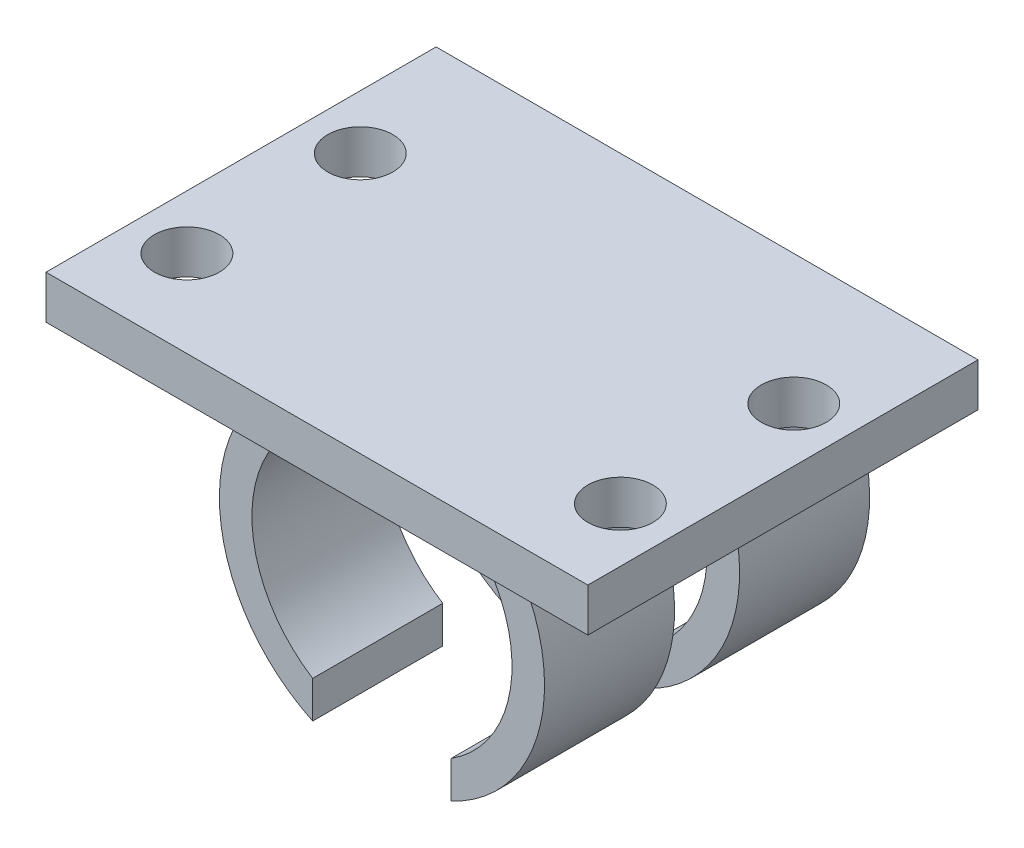
ISO-10303-21;
HEADER;
FILE_DESCRIPTION(('STEP AP214'),'2;1');
FILE_NAME('part.step','',(''),(''),'','','');
FILE_SCHEMA(('AUTOMOTIVE_DESIGN { 1 0 10303 214 1 1 1 1 }'));
ENDSEC;
DATA;
#1=APPLICATION_CONTEXT('core data for automotive mechanical design processes');
#2=APPLICATION_PROTOCOL_DEFINITION('international standard','automotive_design',2000,#1);
#3=PRODUCT_CONTEXT('',#1,'mechanical');
#4=PRODUCT('Part','Part','',(#3));
#5=PRODUCT_RELATED_PRODUCT_CATEGORY('part','',(#4));
#6=PRODUCT_DEFINITION_FORMATION('','',#4);
#7=PRODUCT_DEFINITION_CONTEXT('part definition',#1,'design');
#8=PRODUCT_DEFINITION('design','',#6,#7);
#9=PRODUCT_DEFINITION_SHAPE('','',#8);
#10=(LENGTH_UNIT() NAMED_UNIT(*) SI_UNIT(.MILLI.,.METRE.));
#11=(NAMED_UNIT(*) PLANE_ANGLE_UNIT() SI_UNIT($,.RADIAN.));
#12=(NAMED_UNIT(*) SI_UNIT($,.STERADIAN.) SOLID_ANGLE_UNIT());
#13=UNCERTAINTY_MEASURE_WITH_UNIT(LENGTH_MEASURE(1.E-05),#10,'distance_accuracy_value','');
#14=(GEOMETRIC_REPRESENTATION_CONTEXT(3) GLOBAL_UNCERTAINTY_ASSIGNED_CONTEXT((#13)) GLOBAL_UNIT_ASSIGNED_CONTEXT((#10,
#11,#12)) REPRESENTATION_CONTEXT('',''));
#15=CARTESIAN_POINT('',(0.,0.,0.));
#16=DIRECTION('',(0.,0.,1.));
#17=DIRECTION('',(1.,0.,0.));
#18=AXIS2_PLACEMENT_3D('',#15,#16,#17);
#19=CARTESIAN_POINT('',(-3.19588061843874,0.,15.));
#20=DIRECTION('',(1.,0.,0.));
#21=DIRECTION('',(0.,0.,-1.));
#22=AXIS2_PLACEMENT_3D('',#19,#20,#21);
#23=PLANE('',#22);
#24=DIRECTION('',(0.,-1.,0.));
#25=VECTOR('',#24,1.);
#26=CARTESIAN_POINT('',(-3.19588061843874,0.,9.));
#27=LINE('',#26,#25);
#28=CARTESIAN_POINT('',(-3.19588061843874,-5.07802590311311,9.));
#29=VERTEX_POINT('',#28);
#30=CARTESIAN_POINT('',(-3.19588061843874,-6.78500899577057,9.));
#31=VERTEX_POINT('',#30);
#32=EDGE_CURVE('E250',#29,#31,#27,.T.);
#33=ORIENTED_EDGE('',*,*,#32,.F.);
#34=DIRECTION('',(0.,0.,-1.));
#35=VECTOR('',#34,1.);
#36=CARTESIAN_POINT('',(-3.19588061843874,-5.07802590311311,15.));
#37=LINE('',#36,#35);
#38=CARTESIAN_POINT('',(-3.19588061843874,-5.07802590311311,15.));
#39=VERTEX_POINT('',#38);
#40=EDGE_CURVE('E317',#39,#29,#37,.T.);
#41=ORIENTED_EDGE('',*,*,#40,.F.);
#42=DIRECTION('',(0.,-1.,0.));
#43=VECTOR('',#42,1.);
#44=CARTESIAN_POINT('',(-3.19588061843874,0.,15.));
#45=LINE('',#44,#43);
#46=CARTESIAN_POINT('',(-3.19588061843874,-6.78500899577057,15.));
#47=VERTEX_POINT('',#46);
#48=EDGE_CURVE('E273',#39,#47,#45,.T.);
#49=ORIENTED_EDGE('',*,*,#48,.T.);
#50=DIRECTION('',(0.,0.,-1.));
#51=VECTOR('',#50,1.);
#52=CARTESIAN_POINT('',(-3.19588061843874,-6.78500899577057,15.));
#53=LINE('',#52,#51);
#54=EDGE_CURVE('E321',#47,#31,#53,.T.);
#55=ORIENTED_EDGE('',*,*,#54,.T.);
#56=EDGE_LOOP('',(#33,#41,#49,#55));
#57=FACE_BOUND('',#56,.T.);
#58=ADVANCED_FACE('F41',(#57),#23,.T.);
#59=CARTESIAN_POINT('',(3.19588060787419,-0.000259857829272418,15.));
#60=DIRECTION('',(0.999999996694322,-8.13102428711384E-05,0.));
#61=DIRECTION('',(8.13102428711384E-05,0.999999996694322,0.));
#62=AXIS2_PLACEMENT_3D('',#59,#60,#61);
#63=PLANE('',#62);
#64=DIRECTION('',(0.,0.,-1.));
#65=VECTOR('',#64,1.);
#66=CARTESIAN_POINT('',(3.1954677123547,-5.07828574415607,15.));
#67=LINE('',#66,#65);
#68=CARTESIAN_POINT('',(3.1954677123547,-5.07828574415607,15.));
#69=VERTEX_POINT('',#68);
#70=CARTESIAN_POINT('',(3.1954677123547,-5.07828574415607,9.));
#71=VERTEX_POINT('',#70);
#72=EDGE_CURVE('E309',#69,#71,#67,.T.);
#73=ORIENTED_EDGE('',*,*,#72,.T.);
#74=DIRECTION('',(-8.13102428711384E-05,-0.999999996694322,0.));
#75=VECTOR('',#74,1.);
#76=CARTESIAN_POINT('',(3.19588060787419,-0.000259857829272418,9.));
#77=LINE('',#76,#75);
#78=CARTESIAN_POINT('',(3.19532891714486,-6.7852688311708,9.));
#79=VERTEX_POINT('',#78);
#80=EDGE_CURVE('E49',#71,#79,#77,.T.);
#81=ORIENTED_EDGE('',*,*,#80,.T.);
#82=DIRECTION('',(0.,0.,-1.));
#83=VECTOR('',#82,1.);
#84=CARTESIAN_POINT('',(3.19532891714486,-6.7852688311708,15.));
#85=LINE('',#84,#83);
#86=CARTESIAN_POINT('',(3.19532891714486,-6.7852688311708,15.));
#87=VERTEX_POINT('',#86);
#88=EDGE_CURVE('E305',#87,#79,#85,.T.);
#89=ORIENTED_EDGE('',*,*,#88,.F.);
#90=DIRECTION('',(-8.13102428711384E-05,-0.999999996694322,0.));
#91=VECTOR('',#90,1.);
#92=CARTESIAN_POINT('',(3.19588060787419,-0.000259857829272418,15.));
#93=LINE('',#92,#91);
#94=EDGE_CURVE('E283',#69,#87,#93,.T.);
#95=ORIENTED_EDGE('',*,*,#94,.F.);
#96=EDGE_LOOP('',(#73,#81,#89,#95));
#97=FACE_BOUND('',#96,.T.);
#98=ADVANCED_FACE('F332',(#97),#63,.F.);
#99=CARTESIAN_POINT('',(0.,0.,15.));
#100=DIRECTION('',(0.,0.,-1.));
#101=DIRECTION('',(-1.,0.,0.));
#102=AXIS2_PLACEMENT_3D('',#99,#100,#101);
#103=CYLINDRICAL_SURFACE('',#102,7.5);
#104=CARTESIAN_POINT('',(0.,0.,6.));
#105=DIRECTION('',(0.,0.,-1.));
#106=DIRECTION('',(-1.,0.,0.));
#107=AXIS2_PLACEMENT_3D('',#104,#105,#106);
#108=CIRCLE('',#107,7.5);
#109=CARTESIAN_POINT('',(3.19532891714486,-6.7852688311708,6.));
#110=VERTEX_POINT('',#109);
#111=CARTESIAN_POINT('',(6.77609795621035,3.2147311688292,6.));
#112=VERTEX_POINT('',#111);
#113=EDGE_CURVE('E235',#110,#112,#108,.F.);
#114=ORIENTED_EDGE('',*,*,#113,.F.);
#115=CARTESIAN_POINT('',(3.19532891714486,-6.7852688311708,0.));
#116=VERTEX_POINT('',#115);
#117=EDGE_CURVE('E285',#110,#116,#85,.T.);
#118=ORIENTED_EDGE('',*,*,#117,.T.);
#119=CARTESIAN_POINT('',(0.,0.,0.));
#120=DIRECTION('',(0.,0.,1.));
#121=DIRECTION('',(1.,0.,0.));
#122=AXIS2_PLACEMENT_3D('',#119,#120,#121);
#123=CIRCLE('',#122,7.5);
#124=CARTESIAN_POINT('',(4.50092143540609,5.9993088128802,0.));
#125=VERTEX_POINT('',#124);
#126=EDGE_CURVE('E263',#125,#116,#123,.F.);
#127=ORIENTED_EDGE('',*,*,#126,.F.);
#128=DIRECTION('',(0.,0.,-1.));
#129=VECTOR('',#128,1.);
#130=CARTESIAN_POINT('',(4.50092143540609,5.9993088128802,15.));
#131=LINE('',#130,#129);
#132=CARTESIAN_POINT('',(4.50092143540609,5.9993088128802,15.));
#133=VERTEX_POINT('',#132);
#134=EDGE_CURVE('E326',#133,#125,#131,.T.);
#135=ORIENTED_EDGE('',*,*,#134,.F.);
#136=CARTESIAN_POINT('',(0.,0.,15.));
#137=DIRECTION('',(0.,0.,1.));
#138=DIRECTION('',(1.,0.,0.));
#139=AXIS2_PLACEMENT_3D('',#136,#137,#138);
#140=CIRCLE('',#139,7.5);
#141=EDGE_CURVE('E264',#133,#87,#140,.F.);
#142=ORIENTED_EDGE('',*,*,#141,.T.);
#143=ORIENTED_EDGE('',*,*,#88,.T.);
#144=CARTESIAN_POINT('',(0.,0.,9.));
#145=DIRECTION('',(0.,0.,1.));
#146=DIRECTION('',(1.,0.,0.));
#147=AXIS2_PLACEMENT_3D('',#144,#145,#146);
#148=CIRCLE('',#147,7.5);
#149=CARTESIAN_POINT('',(6.77609795621035,3.2147311688292,9.));
#150=VERTEX_POINT('',#149);
#151=EDGE_CURVE('E245',#150,#79,#148,.F.);
#152=ORIENTED_EDGE('',*,*,#151,.F.);
#153=DIRECTION('',(0.,0.,-1.));
#154=VECTOR('',#153,1.);
#155=CARTESIAN_POINT('',(6.77609795621035,3.2147311688292,15.));
#156=LINE('',#155,#154);
#157=EDGE_CURVE('E261',#112,#150,#156,.F.);
#158=ORIENTED_EDGE('',*,*,#157,.F.);
#159=EDGE_LOOP('',(#114,#118,#127,#135,#142,#143,#152,#158));
#160=FACE_BOUND('',#159,.T.);
#161=ADVANCED_FACE('F43',(#160),#103,.T.);
#162=CARTESIAN_POINT('',(0.,0.,15.));
#163=DIRECTION('',(0.,0.,-1.));
#164=DIRECTION('',(-1.,0.,0.));
#165=AXIS2_PLACEMENT_3D('',#162,#163,#164);
#166=CYLINDRICAL_SURFACE('',#165,7.5);
#167=DIRECTION('',(0.,0.,-1.));
#168=VECTOR('',#167,1.);
#169=CARTESIAN_POINT('',(-6.77609795621034,3.2147311688292,15.));
#170=LINE('',#169,#168);
#171=CARTESIAN_POINT('',(-6.77609795621034,3.2147311688292,6.));
#172=VERTEX_POINT('',#171);
#173=CARTESIAN_POINT('',(-6.77609795621034,3.2147311688292,9.));
#174=VERTEX_POINT('',#173);
#175=EDGE_CURVE('E258',#172,#174,#170,.F.);
#176=ORIENTED_EDGE('',*,*,#175,.T.);
#177=CARTESIAN_POINT('',(0.,0.,9.));
#178=DIRECTION('',(0.,0.,1.));
#179=DIRECTION('',(1.,0.,0.));
#180=AXIS2_PLACEMENT_3D('',#177,#178,#179);
#181=CIRCLE('',#180,7.5);
#182=EDGE_CURVE('E253',#174,#31,#181,.T.);
#183=ORIENTED_EDGE('',*,*,#182,.T.);
#184=ORIENTED_EDGE('',*,*,#54,.F.);
#185=CARTESIAN_POINT('',(0.,0.,15.));
#186=DIRECTION('',(0.,0.,1.));
#187=DIRECTION('',(1.,0.,0.));
#188=AXIS2_PLACEMENT_3D('',#185,#186,#187);
#189=CIRCLE('',#188,7.5);
#190=CARTESIAN_POINT('',(-4.50043362796217,5.99967475454355,15.));
#191=VERTEX_POINT('',#190);
#192=EDGE_CURVE('E271',#191,#47,#189,.T.);
#193=ORIENTED_EDGE('',*,*,#192,.F.);
#194=DIRECTION('',(0.,0.,-1.));
#195=VECTOR('',#194,1.);
#196=CARTESIAN_POINT('',(-4.50043362796217,5.99967475454355,15.));
#197=LINE('',#196,#195);
#198=CARTESIAN_POINT('',(-4.50043362796217,5.99967475454355,0.));
#199=VERTEX_POINT('',#198);
#200=EDGE_CURVE('E324',#191,#199,#197,.T.);
#201=ORIENTED_EDGE('',*,*,#200,.T.);
#202=CARTESIAN_POINT('',(0.,0.,0.));
#203=DIRECTION('',(0.,0.,1.));
#204=DIRECTION('',(1.,0.,0.));
#205=AXIS2_PLACEMENT_3D('',#202,#203,#204);
#206=CIRCLE('',#205,7.5);
#207=CARTESIAN_POINT('',(-3.19588061843874,-6.78500899577057,0.));
#208=VERTEX_POINT('',#207);
#209=EDGE_CURVE('E288',#199,#208,#206,.T.);
#210=ORIENTED_EDGE('',*,*,#209,.T.);
#211=CARTESIAN_POINT('',(-3.19588061843874,-6.78500899577057,6.));
#212=VERTEX_POINT('',#211);
#213=EDGE_CURVE('E320',#212,#208,#53,.T.);
#214=ORIENTED_EDGE('',*,*,#213,.F.);
#215=CARTESIAN_POINT('',(0.,0.,6.));
#216=DIRECTION('',(0.,0.,-1.));
#217=DIRECTION('',(-1.,0.,0.));
#218=AXIS2_PLACEMENT_3D('',#215,#216,#217);
#219=CIRCLE('',#218,7.5);
#220=EDGE_CURVE('E240',#212,#172,#219,.T.);
#221=ORIENTED_EDGE('',*,*,#220,.T.);
#222=EDGE_LOOP('',(#176,#183,#184,#193,#201,#210,#214,#221));
#223=FACE_BOUND('',#222,.T.);
#224=ADVANCED_FACE('F346',(#223),#166,.T.);
#225=DIRECTION('',(0.,1.,0.));
#226=VECTOR('',#225,1.);
#227=CARTESIAN_POINT('',(-3.19588061843874,0.,6.));
#228=LINE('',#227,#226);
#229=CARTESIAN_POINT('',(-3.19588061843874,-5.07802590311311,6.));
#230=VERTEX_POINT('',#229);
#231=EDGE_CURVE('E56',#212,#230,#228,.T.);
#232=ORIENTED_EDGE('',*,*,#231,.F.);
#233=ORIENTED_EDGE('',*,*,#213,.T.);
#234=DIRECTION('',(0.,-1.,0.));
#235=VECTOR('',#234,1.);
#236=CARTESIAN_POINT('',(-3.19588061843874,0.,0.));
#237=LINE('',#236,#235);
#238=CARTESIAN_POINT('',(-3.19588061843874,-5.07802590311311,0.));
#239=VERTEX_POINT('',#238);
#240=EDGE_CURVE('E291',#239,#208,#237,.T.);
#241=ORIENTED_EDGE('',*,*,#240,.F.);
#242=EDGE_CURVE('E316',#230,#239,#37,.T.);
#243=ORIENTED_EDGE('',*,*,#242,.F.);
#244=EDGE_LOOP('',(#232,#233,#241,#243));
#245=FACE_BOUND('',#244,.T.);
#246=ADVANCED_FACE('F356',(#245),#23,.T.);
#247=CARTESIAN_POINT('',(0.,0.,15.));
#248=DIRECTION('',(0.,0.,-1.));
#249=DIRECTION('',(-1.,0.,0.));
#250=AXIS2_PLACEMENT_3D('',#247,#248,#249);
#251=CYLINDRICAL_SURFACE('',#250,6.);
#252=ORIENTED_EDGE('',*,*,#40,.T.);
#253=CARTESIAN_POINT('',(0.,0.,9.));
#254=DIRECTION('',(0.,0.,1.));
#255=DIRECTION('',(1.,0.,0.));
#256=AXIS2_PLACEMENT_3D('',#253,#254,#255);
#257=CIRCLE('',#256,6.);
#258=CARTESIAN_POINT('',(-5.06611325496757,3.2147311688292,9.));
#259=VERTEX_POINT('',#258);
#260=EDGE_CURVE('E247',#29,#259,#257,.F.);
#261=ORIENTED_EDGE('',*,*,#260,.T.);
#262=DIRECTION('',(0.,0.,-1.));
#263=VECTOR('',#262,1.);
#264=CARTESIAN_POINT('',(-5.06611325496757,3.2147311688292,15.));
#265=LINE('',#264,#263);
#266=CARTESIAN_POINT('',(-5.06611325496757,3.2147311688292,6.));
#267=VERTEX_POINT('',#266);
#268=EDGE_CURVE('E255',#259,#267,#265,.T.);
#269=ORIENTED_EDGE('',*,*,#268,.T.);
#270=CARTESIAN_POINT('',(0.,0.,6.));
#271=DIRECTION('',(0.,0.,-1.));
#272=DIRECTION('',(-1.,0.,0.));
#273=AXIS2_PLACEMENT_3D('',#270,#271,#272);
#274=CIRCLE('',#273,6.);
#275=EDGE_CURVE('E237',#267,#230,#274,.F.);
#276=ORIENTED_EDGE('',*,*,#275,.T.);
#277=ORIENTED_EDGE('',*,*,#242,.T.);
#278=CARTESIAN_POINT('',(0.,0.,0.));
#279=DIRECTION('',(0.,0.,1.));
#280=DIRECTION('',(1.,0.,0.));
#281=AXIS2_PLACEMENT_3D('',#278,#279,#280);
#282=CIRCLE('',#281,6.);
#283=CARTESIAN_POINT('',(-3.31642151200714,5.00013483365162,0.));
#284=VERTEX_POINT('',#283);
#285=EDGE_CURVE('E294',#239,#284,#282,.F.);
#286=ORIENTED_EDGE('',*,*,#285,.T.);
#287=DIRECTION('',(0.,0.,-1.));
#288=VECTOR('',#287,1.);
#289=CARTESIAN_POINT('',(-3.31642151200714,5.00013483365162,15.));
#290=LINE('',#289,#288);
#291=CARTESIAN_POINT('',(-3.31642151200714,5.00013483365162,15.));
#292=VERTEX_POINT('',#291);
#293=EDGE_CURVE('E314',#292,#284,#290,.T.);
#294=ORIENTED_EDGE('',*,*,#293,.F.);
#295=CARTESIAN_POINT('',(0.,0.,15.));
#296=DIRECTION('',(0.,0.,1.));
#297=DIRECTION('',(1.,0.,0.));
#298=AXIS2_PLACEMENT_3D('',#295,#296,#297);
#299=CIRCLE('',#298,6.);
#300=EDGE_CURVE('E276',#39,#292,#299,.F.);
#301=ORIENTED_EDGE('',*,*,#300,.F.);
#302=EDGE_LOOP('',(#252,#261,#269,#276,#277,#286,#294,#301));
#303=FACE_BOUND('',#302,.T.);
#304=ADVANCED_FACE('F366',(#303),#251,.F.);
#305=CARTESIAN_POINT('',(0.000203275607340872,4.9999999958679,15.));
#306=DIRECTION('',(-4.06551214681743E-05,-0.99999999917358,0.));
#307=DIRECTION('',(0.999999999173581,-4.06551214681743E-05,0.));
#308=AXIS2_PLACEMENT_3D('',#305,#306,#307);
#309=PLANE('',#308);
#310=DIRECTION('',(-0.999999999173581,4.06551214681743E-05,0.));
#311=VECTOR('',#310,1.);
#312=CARTESIAN_POINT('',(0.000203275607340872,4.9999999958679,0.));
#313=LINE('',#312,#311);
#314=CARTESIAN_POINT('',(3.31682806322183,4.99986515808419,0.));
#315=VERTEX_POINT('',#314);
#316=EDGE_CURVE('E297',#315,#284,#313,.T.);
#317=ORIENTED_EDGE('',*,*,#316,.F.);
#318=DIRECTION('',(0.,0.,-1.));
#319=VECTOR('',#318,1.);
#320=CARTESIAN_POINT('',(3.31682806322183,4.99986515808419,15.));
#321=LINE('',#320,#319);
#322=CARTESIAN_POINT('',(3.31682806322183,4.99986515808419,15.));
#323=VERTEX_POINT('',#322);
#324=EDGE_CURVE('E312',#323,#315,#321,.T.);
#325=ORIENTED_EDGE('',*,*,#324,.F.);
#326=DIRECTION('',(-0.999999999173581,4.06551214681743E-05,0.));
#327=VECTOR('',#326,1.);
#328=CARTESIAN_POINT('',(0.000203275607340872,4.9999999958679,15.));
#329=LINE('',#328,#327);
#330=EDGE_CURVE('E278',#323,#292,#329,.T.);
#331=ORIENTED_EDGE('',*,*,#330,.T.);
#332=ORIENTED_EDGE('',*,*,#293,.T.);
#333=EDGE_LOOP('',(#317,#325,#331,#332));
#334=FACE_BOUND('',#333,.T.);
#335=ADVANCED_FACE('F377',(#334),#309,.T.);
#336=CARTESIAN_POINT('',(0.,0.,15.));
#337=DIRECTION('',(0.,0.,-1.));
#338=DIRECTION('',(-1.,0.,0.));
#339=AXIS2_PLACEMENT_3D('',#336,#337,#338);
#340=CYLINDRICAL_SURFACE('',#339,6.00000000000001);
#341=DIRECTION('',(0.,0.,-1.));
#342=VECTOR('',#341,1.);
#343=CARTESIAN_POINT('',(5.06611325496757,3.2147311688292,15.));
#344=LINE('',#343,#342);
#345=CARTESIAN_POINT('',(5.06611325496757,3.2147311688292,6.));
#346=VERTEX_POINT('',#345);
#347=CARTESIAN_POINT('',(5.06611325496757,3.2147311688292,9.));
#348=VERTEX_POINT('',#347);
#349=EDGE_CURVE('E11',#346,#348,#344,.F.);
#350=ORIENTED_EDGE('',*,*,#349,.T.);
#351=CARTESIAN_POINT('',(0.,0.,9.));
#352=DIRECTION('',(0.,0.,1.));
#353=DIRECTION('',(1.,0.,0.));
#354=AXIS2_PLACEMENT_3D('',#351,#352,#353);
#355=CIRCLE('',#354,6.00000000000001);
#356=EDGE_CURVE('E242',#348,#71,#355,.F.);
#357=ORIENTED_EDGE('',*,*,#356,.T.);
#358=ORIENTED_EDGE('',*,*,#72,.F.);
#359=CARTESIAN_POINT('',(0.,0.,15.));
#360=DIRECTION('',(0.,0.,1.));
#361=DIRECTION('',(1.,0.,0.));
#362=AXIS2_PLACEMENT_3D('',#359,#360,#361);
#363=CIRCLE('',#362,6.00000000000001);
#364=EDGE_CURVE('E281',#323,#69,#363,.F.);
#365=ORIENTED_EDGE('',*,*,#364,.F.);
#366=ORIENTED_EDGE('',*,*,#324,.T.);
#367=CARTESIAN_POINT('',(0.,0.,0.));
#368=DIRECTION('',(0.,0.,1.));
#369=DIRECTION('',(1.,0.,0.));
#370=AXIS2_PLACEMENT_3D('',#367,#368,#369);
#371=CIRCLE('',#370,6.00000000000001);
#372=CARTESIAN_POINT('',(3.1954677123547,-5.07828574415607,0.));
#373=VERTEX_POINT('',#372);
#374=EDGE_CURVE('E300',#315,#373,#371,.F.);
#375=ORIENTED_EDGE('',*,*,#374,.T.);
#376=CARTESIAN_POINT('',(3.1954677123547,-5.07828574415607,6.));
#377=VERTEX_POINT('',#376);
#378=EDGE_CURVE('E308',#377,#373,#67,.T.);
#379=ORIENTED_EDGE('',*,*,#378,.F.);
#380=CARTESIAN_POINT('',(0.,0.,6.));
#381=DIRECTION('',(0.,0.,-1.));
#382=DIRECTION('',(-1.,0.,0.));
#383=AXIS2_PLACEMENT_3D('',#380,#381,#382);
#384=CIRCLE('',#383,6.00000000000001);
#385=EDGE_CURVE('E64',#377,#346,#384,.F.);
#386=ORIENTED_EDGE('',*,*,#385,.T.);
#387=EDGE_LOOP('',(#350,#357,#358,#365,#366,#375,#379,#386));
#388=FACE_BOUND('',#387,.T.);
#389=ADVANCED_FACE('F381',(#388),#340,.F.);
#390=ORIENTED_EDGE('',*,*,#117,.F.);
#391=DIRECTION('',(8.13102428711384E-05,0.999999996694322,0.));
#392=VECTOR('',#391,1.);
#393=CARTESIAN_POINT('',(3.19588060787419,-0.000259857829272418,6.));
#394=LINE('',#393,#392);
#395=EDGE_CURVE('E328',#110,#377,#394,.T.);
#396=ORIENTED_EDGE('',*,*,#395,.T.);
#397=ORIENTED_EDGE('',*,*,#378,.T.);
#398=DIRECTION('',(-8.13102428711384E-05,-0.999999996694322,0.));
#399=VECTOR('',#398,1.);
#400=CARTESIAN_POINT('',(3.19588060787419,-0.000259857829272418,0.));
#401=LINE('',#400,#399);
#402=EDGE_CURVE('E268',#373,#116,#401,.T.);
#403=ORIENTED_EDGE('',*,*,#402,.T.);
#404=EDGE_LOOP('',(#390,#396,#397,#403));
#405=FACE_BOUND('',#404,.T.);
#406=ADVANCED_FACE('F390',(#405),#63,.F.);
#407=CARTESIAN_POINT('',(0.,0.,15.));
#408=DIRECTION('',(0.,0.,1.));
#409=DIRECTION('',(1.,0.,0.));
#410=AXIS2_PLACEMENT_3D('',#407,#408,#409);
#411=PLANE('',#410);
#412=ORIENTED_EDGE('',*,*,#141,.F.);
#413=DIRECTION('',(0.999999999173624,-4.06540638019069E-05,0.));
#414=VECTOR('',#413,1.);
#415=CARTESIAN_POINT('',(0.000243903721955595,5.99949178371188,15.));
#416=LINE('',#415,#414);
#417=EDGE_CURVE('E267',#191,#133,#416,.T.);
#418=ORIENTED_EDGE('',*,*,#417,.F.);
#419=ORIENTED_EDGE('',*,*,#192,.T.);
#420=ORIENTED_EDGE('',*,*,#48,.F.);
#421=ORIENTED_EDGE('',*,*,#300,.T.);
#422=ORIENTED_EDGE('',*,*,#330,.F.);
#423=ORIENTED_EDGE('',*,*,#364,.T.);
#424=ORIENTED_EDGE('',*,*,#94,.T.);
#425=EDGE_LOOP('',(#412,#418,#419,#420,#421,#422,#423,#424));
#426=FACE_BOUND('',#425,.T.);
#427=ADVANCED_FACE('F342',(#426),#411,.T.);
#428=CARTESIAN_POINT('',(0.,0.,0.));
#429=DIRECTION('',(0.,0.,1.));
#430=DIRECTION('',(1.,0.,0.));
#431=AXIS2_PLACEMENT_3D('',#428,#429,#430);
#432=PLANE('',#431);
#433=ORIENTED_EDGE('',*,*,#126,.T.);
#434=ORIENTED_EDGE('',*,*,#402,.F.);
#435=ORIENTED_EDGE('',*,*,#374,.F.);
#436=ORIENTED_EDGE('',*,*,#316,.T.);
#437=ORIENTED_EDGE('',*,*,#285,.F.);
#438=ORIENTED_EDGE('',*,*,#240,.T.);
#439=ORIENTED_EDGE('',*,*,#209,.F.);
#440=DIRECTION('',(0.999999999173624,-4.06540638019069E-05,0.));
#441=VECTOR('',#440,1.);
#442=CARTESIAN_POINT('',(0.000243903721955595,5.99949178371188,0.));
#443=LINE('',#442,#441);
#444=CARTESIAN_POINT('',(-12.5006504246368,5.9999999958679,0.));
#445=VERTEX_POINT('',#444);
#446=EDGE_CURVE('E213',#445,#199,#443,.T.);
#447=ORIENTED_EDGE('',*,*,#446,.F.);
#448=DIRECTION('',(0.,1.,0.));
#449=VECTOR('',#448,1.);
#450=CARTESIAN_POINT('',(-12.5006504246368,0.,0.));
#451=LINE('',#450,#449);
#452=CARTESIAN_POINT('',(-12.5006504246368,8.00034562911295,0.));
#453=VERTEX_POINT('',#452);
#454=EDGE_CURVE('E189',#445,#453,#451,.T.);
#455=ORIENTED_EDGE('',*,*,#454,.T.);
#456=DIRECTION('',(-0.999999999173438,4.06586283130755E-05,0.));
#457=VECTOR('',#456,1.);
#458=CARTESIAN_POINT('',(0.000325262413915438,7.99983735658852,0.));
#459=LINE('',#458,#457);
#460=CARTESIAN_POINT('',(12.5006504742254,7.99932911051152,0.));
#461=VERTEX_POINT('',#460);
#462=EDGE_CURVE('E218',#461,#453,#459,.T.);
#463=ORIENTED_EDGE('',*,*,#462,.F.);
#464=DIRECTION('',(-8.1310242876319E-05,-0.999999996694322,0.));
#465=VECTOR('',#464,1.);
#466=CARTESIAN_POINT('',(12.4999999641885,-0.00101637803640196,0.));
#467=LINE('',#466,#465);
#468=CARTESIAN_POINT('',(12.5004878256454,5.99898359799752,0.));
#469=VERTEX_POINT('',#468);
#470=EDGE_CURVE('E216',#461,#469,#467,.T.);
#471=ORIENTED_EDGE('',*,*,#470,.T.);
#472=EDGE_CURVE('E197',#125,#469,#443,.T.);
#473=ORIENTED_EDGE('',*,*,#472,.F.);
#474=EDGE_LOOP('',(#433,#434,#435,#436,#437,#438,#439,#447,#455,#463,#471,#473));
#475=FACE_BOUND('',#474,.T.);
#476=ADVANCED_FACE('F350',(#475),#432,.F.);
#477=CARTESIAN_POINT('',(-7.5,-6.7852688311708,9.));
#478=DIRECTION('',(0.,0.,1.));
#479=DIRECTION('',(1.,0.,0.));
#480=AXIS2_PLACEMENT_3D('',#477,#478,#479);
#481=PLANE('',#480);
#482=ORIENTED_EDGE('',*,*,#151,.T.);
#483=ORIENTED_EDGE('',*,*,#80,.F.);
#484=ORIENTED_EDGE('',*,*,#356,.F.);
#485=DIRECTION('',(1.,0.,0.));
#486=VECTOR('',#485,1.);
#487=CARTESIAN_POINT('',(-7.5,3.2147311688292,9.));
#488=LINE('',#487,#486);
#489=EDGE_CURVE('E227',#348,#150,#488,.T.);
#490=ORIENTED_EDGE('',*,*,#489,.T.);
#491=EDGE_LOOP('',(#482,#483,#484,#490));
#492=FACE_BOUND('',#491,.T.);
#493=ADVANCED_FACE('F383',(#492),#481,.F.);
#494=CARTESIAN_POINT('',(-7.5,3.2147311688292,6.));
#495=DIRECTION('',(0.,0.,-1.));
#496=DIRECTION('',(-1.,0.,0.));
#497=AXIS2_PLACEMENT_3D('',#494,#495,#496);
#498=PLANE('',#497);
#499=ORIENTED_EDGE('',*,*,#113,.T.);
#500=DIRECTION('',(1.,0.,0.));
#501=VECTOR('',#500,1.);
#502=CARTESIAN_POINT('',(-7.5,3.2147311688292,6.));
#503=LINE('',#502,#501);
#504=EDGE_CURVE('E201',#346,#112,#503,.T.);
#505=ORIENTED_EDGE('',*,*,#504,.F.);
#506=ORIENTED_EDGE('',*,*,#385,.F.);
#507=ORIENTED_EDGE('',*,*,#395,.F.);
#508=EDGE_LOOP('',(#499,#505,#506,#507));
#509=FACE_BOUND('',#508,.T.);
#510=ADVANCED_FACE('F387',(#509),#498,.F.);
#511=CARTESIAN_POINT('',(-7.5,3.2147311688292,9.));
#512=DIRECTION('',(0.,1.,0.));
#513=DIRECTION('',(0.,0.,1.));
#514=AXIS2_PLACEMENT_3D('',#511,#512,#513);
#515=PLANE('',#514);
#516=ORIENTED_EDGE('',*,*,#157,.T.);
#517=ORIENTED_EDGE('',*,*,#489,.F.);
#518=ORIENTED_EDGE('',*,*,#349,.F.);
#519=ORIENTED_EDGE('',*,*,#504,.T.);
#520=EDGE_LOOP('',(#516,#517,#518,#519));
#521=FACE_BOUND('',#520,.T.);
#522=ADVANCED_FACE('F385',(#521),#515,.F.);
#523=EDGE_CURVE('E231',#172,#267,#503,.T.);
#524=ORIENTED_EDGE('',*,*,#523,.T.);
#525=ORIENTED_EDGE('',*,*,#268,.F.);
#526=EDGE_CURVE('E230',#174,#259,#488,.T.);
#527=ORIENTED_EDGE('',*,*,#526,.F.);
#528=ORIENTED_EDGE('',*,*,#175,.F.);
#529=EDGE_LOOP('',(#524,#525,#527,#528));
#530=FACE_BOUND('',#529,.T.);
#531=ADVANCED_FACE('F362',(#530),#515,.F.);
#532=ORIENTED_EDGE('',*,*,#526,.T.);
#533=ORIENTED_EDGE('',*,*,#260,.F.);
#534=ORIENTED_EDGE('',*,*,#32,.T.);
#535=ORIENTED_EDGE('',*,*,#182,.F.);
#536=EDGE_LOOP('',(#532,#533,#534,#535));
#537=FACE_BOUND('',#536,.T.);
#538=ADVANCED_FACE('F368',(#537),#481,.F.);
#539=ORIENTED_EDGE('',*,*,#220,.F.);
#540=ORIENTED_EDGE('',*,*,#231,.T.);
#541=ORIENTED_EDGE('',*,*,#275,.F.);
#542=ORIENTED_EDGE('',*,*,#523,.F.);
#543=EDGE_LOOP('',(#539,#540,#541,#542));
#544=FACE_BOUND('',#543,.T.);
#545=ADVANCED_FACE('F364',(#544),#498,.F.);
#546=CARTESIAN_POINT('',(0.000243903721955595,5.99949178371188,18.));
#547=DIRECTION('',(4.06540638019069E-05,0.999999999173623,0.));
#548=DIRECTION('',(-0.999999999173624,4.06540638019069E-05,0.));
#549=AXIS2_PLACEMENT_3D('',#546,#547,#548);
#550=PLANE('',#549);
#551=CARTESIAN_POINT('',(-10.0007317580123,5.99989836401485,6.));
#552=DIRECTION('',(4.06540638019069E-05,0.999999999173623,0.));
#553=DIRECTION('',(-0.999999999173624,4.06540638019069E-05,0.));
#554=AXIS2_PLACEMENT_3D('',#551,#552,#553);
#555=CIRCLE('',#554,1.5);
#556=CARTESIAN_POINT('',(-11.5007317567727,5.99995934511055,6.));
#557=VERTEX_POINT('',#556);
#558=EDGE_CURVE('E399',#557,#557,#555,.T.);
#559=ORIENTED_EDGE('',*,*,#558,.T.);
#560=EDGE_LOOP('',(#559));
#561=FACE_BOUND('',#560,.T.);
#562=CARTESIAN_POINT('',(10.0011112040126,5.99908520781424,6.00027105632517));
#563=DIRECTION('',(4.06540638019069E-05,0.999999999173623,0.));
#564=DIRECTION('',(-0.999999999173624,4.06540638019069E-05,0.));
#565=AXIS2_PLACEMENT_3D('',#562,#563,#564);
#566=CIRCLE('',#565,1.5);
#567=CARTESIAN_POINT('',(8.50111120525216,5.99914618890995,6.00027105632517));
#568=VERTEX_POINT('',#567);
#569=EDGE_CURVE('E404',#568,#568,#566,.T.);
#570=ORIENTED_EDGE('',*,*,#569,.T.);
#571=EDGE_LOOP('',(#570));
#572=FACE_BOUND('',#571,.T.);
#573=CARTESIAN_POINT('',(10.0008943789329,5.99908521662906,14.0002710533869));
#574=DIRECTION('',(4.06540638019069E-05,0.999999999173623,0.));
#575=DIRECTION('',(-0.999999999173624,4.06540638019069E-05,0.));
#576=AXIS2_PLACEMENT_3D('',#573,#574,#575);
#577=CIRCLE('',#576,1.5);
#578=CARTESIAN_POINT('',(8.50089438017243,5.99914619772477,14.0002710533869));
#579=VERTEX_POINT('',#578);
#580=EDGE_CURVE('E407',#579,#579,#577,.T.);
#581=ORIENTED_EDGE('',*,*,#580,.T.);
#582=EDGE_LOOP('',(#581));
#583=FACE_BOUND('',#582,.T.);
#584=CARTESIAN_POINT('',(-10.0007317580123,5.99989836401485,14.));
#585=DIRECTION('',(4.06540638019069E-05,0.999999999173623,0.));
#586=DIRECTION('',(-0.999999999173624,4.06540638019069E-05,0.));
#587=AXIS2_PLACEMENT_3D('',#584,#585,#586);
#588=CIRCLE('',#587,1.5);
#589=CARTESIAN_POINT('',(-11.5007317567727,5.99995934511055,14.));
#590=VERTEX_POINT('',#589);
#591=EDGE_CURVE('E393',#590,#590,#588,.T.);
#592=ORIENTED_EDGE('',*,*,#591,.T.);
#593=EDGE_LOOP('',(#592));
#594=FACE_BOUND('',#593,.T.);
#595=ORIENTED_EDGE('',*,*,#200,.F.);
#596=ORIENTED_EDGE('',*,*,#417,.T.);
#597=ORIENTED_EDGE('',*,*,#134,.T.);
#598=ORIENTED_EDGE('',*,*,#472,.T.);
#599=DIRECTION('',(0.,0.,-1.));
#600=VECTOR('',#599,1.);
#601=CARTESIAN_POINT('',(12.5004878256454,5.99898359799752,18.));
#602=LINE('',#601,#600);
#603=CARTESIAN_POINT('',(12.5004878256454,5.99898359799752,18.));
#604=VERTEX_POINT('',#603);
#605=EDGE_CURVE('E192',#604,#469,#602,.T.);
#606=ORIENTED_EDGE('',*,*,#605,.F.);
#607=DIRECTION('',(0.999999999173624,-4.06540638019069E-05,0.));
#608=VECTOR('',#607,1.);
#609=CARTESIAN_POINT('',(0.000243903721955595,5.99949178371188,18.));
#610=LINE('',#609,#608);
#611=CARTESIAN_POINT('',(-12.5006504246368,5.9999999958679,18.));
#612=VERTEX_POINT('',#611);
#613=EDGE_CURVE('E181',#612,#604,#610,.T.);
#614=ORIENTED_EDGE('',*,*,#613,.F.);
#615=DIRECTION('',(0.,0.,-1.));
#616=VECTOR('',#615,1.);
#617=CARTESIAN_POINT('',(-12.5006504246368,5.9999999958679,18.));
#618=LINE('',#617,#616);
#619=EDGE_CURVE('E212',#612,#445,#618,.T.);
#620=ORIENTED_EDGE('',*,*,#619,.T.);
#621=ORIENTED_EDGE('',*,*,#446,.T.);
#622=EDGE_LOOP('',(#595,#596,#597,#598,#606,#614,#620,#621));
#623=FACE_BOUND('',#622,.T.);
#624=ADVANCED_FACE('F194',(#561,#572,#583,#594,#623),#550,.F.);
#625=CARTESIAN_POINT('',(12.4999999641885,-0.00101637803640196,18.));
#626=DIRECTION('',(0.999999996694322,-8.1310242876319E-05,0.));
#627=DIRECTION('',(8.1310242876319E-05,0.999999996694322,0.));
#628=AXIS2_PLACEMENT_3D('',#625,#626,#627);
#629=PLANE('',#628);
#630=ORIENTED_EDGE('',*,*,#470,.F.);
#631=DIRECTION('',(0.,0.,-1.));
#632=VECTOR('',#631,1.);
#633=CARTESIAN_POINT('',(12.5006504742254,7.99932911051152,18.));
#634=LINE('',#633,#632);
#635=CARTESIAN_POINT('',(12.5006504742254,7.99932911051152,18.));
#636=VERTEX_POINT('',#635);
#637=EDGE_CURVE('E202',#636,#461,#634,.T.);
#638=ORIENTED_EDGE('',*,*,#637,.F.);
#639=DIRECTION('',(-8.1310242876319E-05,-0.999999996694322,0.));
#640=VECTOR('',#639,1.);
#641=CARTESIAN_POINT('',(12.4999999641885,-0.00101637803640196,18.));
#642=LINE('',#641,#640);
#643=EDGE_CURVE('E185',#636,#604,#642,.T.);
#644=ORIENTED_EDGE('',*,*,#643,.T.);
#645=ORIENTED_EDGE('',*,*,#605,.T.);
#646=EDGE_LOOP('',(#630,#638,#644,#645));
#647=FACE_BOUND('',#646,.T.);
#648=ADVANCED_FACE('F204',(#647),#629,.T.);
#649=CARTESIAN_POINT('',(0.000325262413915438,7.99983735658852,18.));
#650=DIRECTION('',(-4.06586283130755E-05,-0.999999999173438,0.));
#651=DIRECTION('',(0.999999999173438,-4.06586283130755E-05,0.));
#652=AXIS2_PLACEMENT_3D('',#649,#650,#651);
#653=PLANE('',#652);
#654=CARTESIAN_POINT('',(-10.0006504267032,8.00024398254217,6.));
#655=DIRECTION('',(4.06586283130755E-05,0.999999999173438,0.));
#656=DIRECTION('',(-0.999999999173438,4.06586283130755E-05,0.));
#657=AXIS2_PLACEMENT_3D('',#654,#655,#656);
#658=CIRCLE('',#657,1.5);
#659=CARTESIAN_POINT('',(-11.5006504254634,8.00030497048464,6.));
#660=VERTEX_POINT('',#659);
#661=EDGE_CURVE('E410',#660,#660,#658,.T.);
#662=ORIENTED_EDGE('',*,*,#661,.F.);
#663=EDGE_LOOP('',(#662));
#664=FACE_BOUND('',#663,.T.);
#665=CARTESIAN_POINT('',(10.001192535318,7.99943073504293,6.00027105632517));
#666=DIRECTION('',(4.06586283130755E-05,0.999999999173438,0.));
#667=DIRECTION('',(0.999999999173438,-4.06586283130755E-05,0.));
#668=AXIS2_PLACEMENT_3D('',#665,#666,#667);
#669=CIRCLE('',#668,1.5);
#670=CARTESIAN_POINT('',(11.5011925340781,7.99936974710046,6.00027105632517));
#671=VERTEX_POINT('',#670);
#672=EDGE_CURVE('E414',#671,#671,#669,.T.);
#673=ORIENTED_EDGE('',*,*,#672,.F.);
#674=EDGE_LOOP('',(#673));
#675=FACE_BOUND('',#674,.T.);
#676=CARTESIAN_POINT('',(10.0009757102382,7.99943074385874,14.0002710533869));
#677=DIRECTION('',(4.06586283130755E-05,0.999999999173438,0.));
#678=DIRECTION('',(-0.999999999173438,4.06586283130755E-05,0.));
#679=AXIS2_PLACEMENT_3D('',#676,#677,#678);
#680=CIRCLE('',#679,1.5);
#681=CARTESIAN_POINT('',(8.50097571147806,7.99949173180121,14.0002710533869));
#682=VERTEX_POINT('',#681);
#683=EDGE_CURVE('E411',#682,#682,#680,.T.);
#684=ORIENTED_EDGE('',*,*,#683,.F.);
#685=EDGE_LOOP('',(#684));
#686=FACE_BOUND('',#685,.T.);
#687=CARTESIAN_POINT('',(-10.0006504267032,8.00024398254217,14.));
#688=DIRECTION('',(4.06586283130755E-05,0.999999999173438,0.));
#689=DIRECTION('',(0.999999999173438,-4.06586283130755E-05,0.));
#690=AXIS2_PLACEMENT_3D('',#687,#688,#689);
#691=CIRCLE('',#690,1.5);
#692=CARTESIAN_POINT('',(-8.50065042794307,8.0001829945997,14.));
#693=VERTEX_POINT('',#692);
#694=EDGE_CURVE('E395',#693,#693,#691,.T.);
#695=ORIENTED_EDGE('',*,*,#694,.F.);
#696=EDGE_LOOP('',(#695));
#697=FACE_BOUND('',#696,.T.);
#698=ORIENTED_EDGE('',*,*,#462,.T.);
#699=DIRECTION('',(0.,0.,-1.));
#700=VECTOR('',#699,1.);
#701=CARTESIAN_POINT('',(-12.5006504246368,8.00034562911295,18.));
#702=LINE('',#701,#700);
#703=CARTESIAN_POINT('',(-12.5006504246368,8.00034562911295,18.));
#704=VERTEX_POINT('',#703);
#705=EDGE_CURVE('E224',#704,#453,#702,.T.);
#706=ORIENTED_EDGE('',*,*,#705,.F.);
#707=DIRECTION('',(-0.999999999173438,4.06586283130755E-05,0.));
#708=VECTOR('',#707,1.);
#709=CARTESIAN_POINT('',(0.000325262413915438,7.99983735658852,18.));
#710=LINE('',#709,#708);
#711=EDGE_CURVE('E206',#636,#704,#710,.T.);
#712=ORIENTED_EDGE('',*,*,#711,.F.);
#713=ORIENTED_EDGE('',*,*,#637,.T.);
#714=EDGE_LOOP('',(#698,#706,#712,#713));
#715=FACE_BOUND('',#714,.T.);
#716=ADVANCED_FACE('F423',(#664,#675,#686,#697,#715),#653,.F.);
#717=CARTESIAN_POINT('',(-12.5006504246368,0.,18.));
#718=DIRECTION('',(-1.,0.,0.));
#719=DIRECTION('',(0.,-1.,0.));
#720=AXIS2_PLACEMENT_3D('',#717,#718,#719);
#721=PLANE('',#720);
#722=ORIENTED_EDGE('',*,*,#454,.F.);
#723=ORIENTED_EDGE('',*,*,#619,.F.);
#724=DIRECTION('',(0.,1.,0.));
#725=VECTOR('',#724,1.);
#726=CARTESIAN_POINT('',(-12.5006504246368,0.,18.));
#727=LINE('',#726,#725);
#728=EDGE_CURVE('E187',#612,#704,#727,.T.);
#729=ORIENTED_EDGE('',*,*,#728,.T.);
#730=ORIENTED_EDGE('',*,*,#705,.T.);
#731=EDGE_LOOP('',(#722,#723,#729,#730));
#732=FACE_BOUND('',#731,.T.);
#733=ADVANCED_FACE('F426',(#732),#721,.T.);
#734=CARTESIAN_POINT('',(0.,0.,18.));
#735=DIRECTION('',(0.,0.,1.));
#736=DIRECTION('',(1.,0.,0.));
#737=AXIS2_PLACEMENT_3D('',#734,#735,#736);
#738=PLANE('',#737);
#739=ORIENTED_EDGE('',*,*,#613,.T.);
#740=ORIENTED_EDGE('',*,*,#643,.F.);
#741=ORIENTED_EDGE('',*,*,#711,.T.);
#742=ORIENTED_EDGE('',*,*,#728,.F.);
#743=EDGE_LOOP('',(#739,#740,#741,#742));
#744=FACE_BOUND('',#743,.T.);
#745=ADVANCED_FACE('F183',(#744),#738,.T.);
#746=CARTESIAN_POINT('',(-10.0010570129864,-1.99975600919221,14.));
#747=DIRECTION('',(4.06586283130755E-05,0.999999999173438,0.));
#748=DIRECTION('',(-0.999999999173438,4.06586283130755E-05,0.));
#749=AXIS2_PLACEMENT_3D('',#746,#747,#748);
#750=CYLINDRICAL_SURFACE('',#749,1.5);
#751=ORIENTED_EDGE('',*,*,#694,.T.);
#752=EDGE_LOOP('',(#751));
#753=FACE_BOUND('',#752,.T.);
#754=ORIENTED_EDGE('',*,*,#591,.F.);
#755=EDGE_LOOP('',(#754));
#756=FACE_BOUND('',#755,.T.);
#757=ADVANCED_FACE('F441',(#753,#756),#750,.F.);
#758=CARTESIAN_POINT('',(10.0005691239551,-2.00056924787564,14.0002710533869));
#759=DIRECTION('',(4.06586283130755E-05,0.999999999173438,0.));
#760=DIRECTION('',(-0.999999999173438,4.06586283130755E-05,0.));
#761=AXIS2_PLACEMENT_3D('',#758,#759,#760);
#762=CYLINDRICAL_SURFACE('',#761,1.5);
#763=ORIENTED_EDGE('',*,*,#683,.T.);
#764=EDGE_LOOP('',(#763));
#765=FACE_BOUND('',#764,.T.);
#766=ORIENTED_EDGE('',*,*,#580,.F.);
#767=EDGE_LOOP('',(#766));
#768=FACE_BOUND('',#767,.T.);
#769=ADVANCED_FACE('F576',(#765,#768),#762,.F.);
#770=CARTESIAN_POINT('',(10.0007859490348,-2.00056925669145,6.00027105632517));
#771=DIRECTION('',(4.06586283130755E-05,0.999999999173438,0.));
#772=DIRECTION('',(-0.999999999173438,4.06586283130755E-05,0.));
#773=AXIS2_PLACEMENT_3D('',#770,#771,#772);
#774=CYLINDRICAL_SURFACE('',#773,1.5);
#775=ORIENTED_EDGE('',*,*,#672,.T.);
#776=EDGE_LOOP('',(#775));
#777=FACE_BOUND('',#776,.T.);
#778=ORIENTED_EDGE('',*,*,#569,.F.);
#779=EDGE_LOOP('',(#778));
#780=FACE_BOUND('',#779,.T.);
#781=ADVANCED_FACE('F587',(#777,#780),#774,.F.);
#782=CARTESIAN_POINT('',(-10.0010570129864,-1.99975600919221,6.));
#783=DIRECTION('',(4.06586283130755E-05,0.999999999173438,0.));
#784=DIRECTION('',(-0.999999999173438,4.06586283130755E-05,0.));
#785=AXIS2_PLACEMENT_3D('',#782,#783,#784);
#786=CYLINDRICAL_SURFACE('',#785,1.5);
#787=ORIENTED_EDGE('',*,*,#661,.T.);
#788=EDGE_LOOP('',(#787));
#789=FACE_BOUND('',#788,.T.);
#790=ORIENTED_EDGE('',*,*,#558,.F.);
#791=EDGE_LOOP('',(#790));
#792=FACE_BOUND('',#791,.T.);
#793=ADVANCED_FACE('F420',(#789,#792),#786,.F.);
#794=CLOSED_SHELL('',(#58,#98,#161,#224,#246,#304,#335,#389,#406,#427,#476,#493,#510,#522,#531,
#538,#545,#624,#648,#716,#733,#745,#757,#769,#781,#793));
#795=MANIFOLD_SOLID_BREP('B2',#794);
#796=ADVANCED_BREP_SHAPE_REPRESENTATION('',(#18,#795),#14);
#797=SHAPE_DEFINITION_REPRESENTATION(#9,#796);
ENDSEC;
END-ISO-10303-21;
